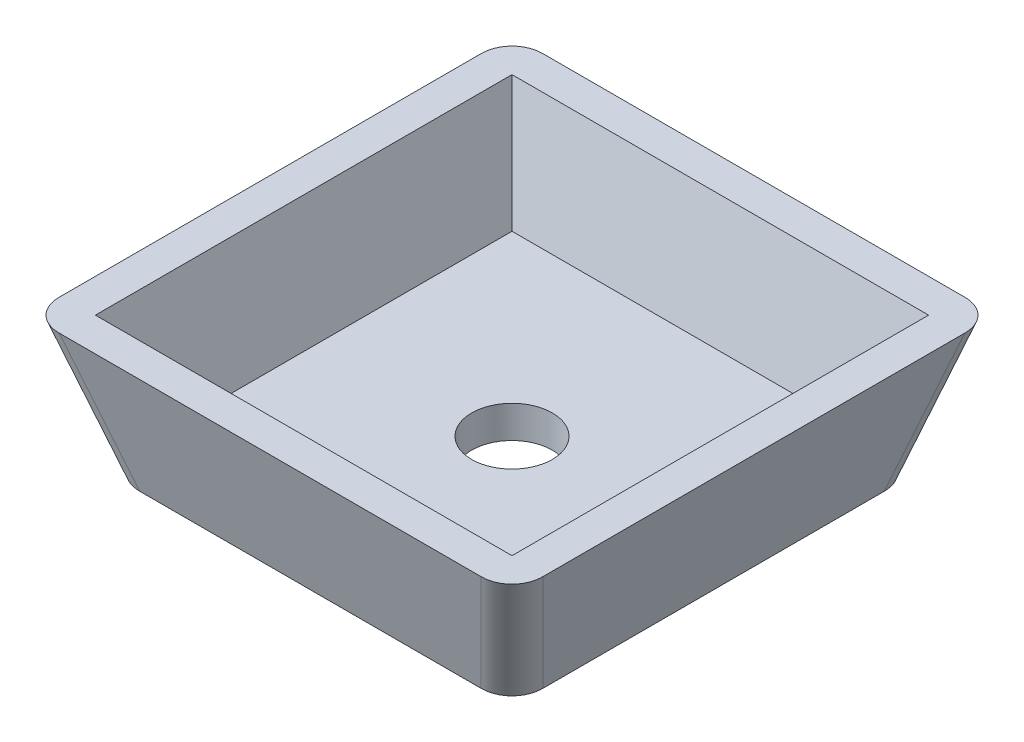
ISO-10303-21;
HEADER;
FILE_DESCRIPTION(('STEP AP214'),'2;1');
FILE_NAME('part.step','',(''),(''),'','','');
FILE_SCHEMA(('AUTOMOTIVE_DESIGN { 1 0 10303 214 1 1 1 1 }'));
ENDSEC;
DATA;
#1=APPLICATION_CONTEXT('core data for automotive mechanical design processes');
#2=APPLICATION_PROTOCOL_DEFINITION('international standard','automotive_design',2000,#1);
#3=PRODUCT_CONTEXT('',#1,'mechanical');
#4=PRODUCT('Part','Part','',(#3));
#5=PRODUCT_RELATED_PRODUCT_CATEGORY('part','',(#4));
#6=PRODUCT_DEFINITION_FORMATION('','',#4);
#7=PRODUCT_DEFINITION_CONTEXT('part definition',#1,'design');
#8=PRODUCT_DEFINITION('design','',#6,#7);
#9=PRODUCT_DEFINITION_SHAPE('','',#8);
#10=(LENGTH_UNIT() NAMED_UNIT(*) SI_UNIT(.MILLI.,.METRE.));
#11=(NAMED_UNIT(*) PLANE_ANGLE_UNIT() SI_UNIT($,.RADIAN.));
#12=(NAMED_UNIT(*) SI_UNIT($,.STERADIAN.) SOLID_ANGLE_UNIT());
#13=UNCERTAINTY_MEASURE_WITH_UNIT(LENGTH_MEASURE(1.E-05),#10,'distance_accuracy_value','');
#14=(GEOMETRIC_REPRESENTATION_CONTEXT(3) GLOBAL_UNCERTAINTY_ASSIGNED_CONTEXT((#13)) GLOBAL_UNIT_ASSIGNED_CONTEXT((#10,
#11,#12)) REPRESENTATION_CONTEXT('',''));
#15=CARTESIAN_POINT('',(0.,0.,0.));
#16=DIRECTION('',(0.,0.,1.));
#17=DIRECTION('',(1.,0.,0.));
#18=AXIS2_PLACEMENT_3D('',#15,#16,#17);
#19=CARTESIAN_POINT('',(0.,0.,0.));
#20=DIRECTION('',(0.,1.,0.));
#21=DIRECTION('',(0.,0.,1.));
#22=AXIS2_PLACEMENT_3D('',#19,#20,#21);
#23=PLANE('',#22);
#24=CARTESIAN_POINT('',(0.,0.,0.));
#25=DIRECTION('',(0.,-1.,0.));
#26=DIRECTION('',(0.,0.,-1.));
#27=AXIS2_PLACEMENT_3D('',#24,#25,#26);
#28=CIRCLE('',#27,2.5);
#29=CARTESIAN_POINT('',(0.,0.,-2.5));
#30=VERTEX_POINT('',#29);
#31=EDGE_CURVE('E461',#30,#30,#28,.T.);
#32=ORIENTED_EDGE('',*,*,#31,.F.);
#33=EDGE_LOOP('',(#32));
#34=FACE_BOUND('',#33,.T.);
#35=DIRECTION('',(-1.,0.,0.));
#36=VECTOR('',#35,1.);
#37=CARTESIAN_POINT('',(12.5,0.,-12.5));
#38=LINE('',#37,#36);
#39=CARTESIAN_POINT('',(10.5812689968575,0.,-12.5));
#40=VERTEX_POINT('',#39);
#41=CARTESIAN_POINT('',(-10.5812689968575,0.,-12.5));
#42=VERTEX_POINT('',#41);
#43=EDGE_CURVE('E281',#40,#42,#38,.T.);
#44=ORIENTED_EDGE('',*,*,#43,.F.);
#45=CARTESIAN_POINT('',(10.4152888062742,0.,-10.4152888062742));
#46=DIRECTION('',(0.,1.,0.));
#47=DIRECTION('',(-0.707106781186547,0.,0.707106781186548));
#48=AXIS2_PLACEMENT_3D('',#45,#46,#47);
#49=ELLIPSE('',#48,2.16611207523788,2.);
#50=CARTESIAN_POINT('',(12.5,0.,-10.5812689968575));
#51=VERTEX_POINT('',#50);
#52=EDGE_CURVE('E411',#40,#51,#49,.F.);
#53=ORIENTED_EDGE('',*,*,#52,.T.);
#54=DIRECTION('',(0.,0.,-1.));
#55=VECTOR('',#54,1.);
#56=CARTESIAN_POINT('',(12.5,0.,12.5));
#57=LINE('',#56,#55);
#58=CARTESIAN_POINT('',(12.5,0.,10.5812689968575));
#59=VERTEX_POINT('',#58);
#60=EDGE_CURVE('E360',#59,#51,#57,.T.);
#61=ORIENTED_EDGE('',*,*,#60,.F.);
#62=CARTESIAN_POINT('',(10.4152888062742,0.,10.4152888062742));
#63=DIRECTION('',(0.,1.,0.));
#64=DIRECTION('',(-0.707106781186547,0.,-0.707106781186548));
#65=AXIS2_PLACEMENT_3D('',#62,#63,#64);
#66=ELLIPSE('',#65,2.16611207523788,2.);
#67=CARTESIAN_POINT('',(10.5812689968575,0.,12.5));
#68=VERTEX_POINT('',#67);
#69=EDGE_CURVE('E234',#59,#68,#66,.F.);
#70=ORIENTED_EDGE('',*,*,#69,.T.);
#71=DIRECTION('',(1.,0.,0.));
#72=VECTOR('',#71,1.);
#73=CARTESIAN_POINT('',(12.5,0.,12.5));
#74=LINE('',#73,#72);
#75=CARTESIAN_POINT('',(-10.5812689968575,0.,12.5));
#76=VERTEX_POINT('',#75);
#77=EDGE_CURVE('E227',#76,#68,#74,.T.);
#78=ORIENTED_EDGE('',*,*,#77,.F.);
#79=CARTESIAN_POINT('',(-10.4152888062742,0.,10.4152888062742));
#80=DIRECTION('',(0.,1.,0.));
#81=DIRECTION('',(0.707106781186547,0.,-0.707106781186548));
#82=AXIS2_PLACEMENT_3D('',#79,#80,#81);
#83=ELLIPSE('',#82,2.16611207523788,2.);
#84=CARTESIAN_POINT('',(-12.5,0.,10.5812689968575));
#85=VERTEX_POINT('',#84);
#86=EDGE_CURVE('E427',#76,#85,#83,.F.);
#87=ORIENTED_EDGE('',*,*,#86,.T.);
#88=DIRECTION('',(0.,0.,1.));
#89=VECTOR('',#88,1.);
#90=CARTESIAN_POINT('',(-12.5,0.,12.5));
#91=LINE('',#90,#89);
#92=CARTESIAN_POINT('',(-12.5,0.,-10.5812689968575));
#93=VERTEX_POINT('',#92);
#94=EDGE_CURVE('E343',#93,#85,#91,.T.);
#95=ORIENTED_EDGE('',*,*,#94,.F.);
#96=CARTESIAN_POINT('',(-10.4152888062742,0.,-10.4152888062742));
#97=DIRECTION('',(0.,1.,0.));
#98=DIRECTION('',(0.707106781186548,0.,0.707106781186547));
#99=AXIS2_PLACEMENT_3D('',#96,#97,#98);
#100=ELLIPSE('',#99,2.16611207523788,2.);
#101=EDGE_CURVE('E423',#93,#42,#100,.F.);
#102=ORIENTED_EDGE('',*,*,#101,.T.);
#103=EDGE_LOOP('',(#44,#53,#61,#70,#78,#87,#95,#102));
#104=FACE_BOUND('',#103,.T.);
#105=ADVANCED_FACE('F53',(#34,#104),#23,.F.);
#106=CARTESIAN_POINT('',(0.,8.5,0.));
#107=DIRECTION('',(0.,1.,0.));
#108=DIRECTION('',(0.,0.,1.));
#109=AXIS2_PLACEMENT_3D('',#106,#107,#108);
#110=PLANE('',#109);
#111=DIRECTION('',(0.,0.,-1.));
#112=VECTOR('',#111,1.);
#113=CARTESIAN_POINT('',(12.9152888062742,8.5,0.));
#114=LINE('',#113,#112);
#115=CARTESIAN_POINT('',(12.9152888062742,8.5,12.9152888062742));
#116=VERTEX_POINT('',#115);
#117=CARTESIAN_POINT('',(12.9152888062742,8.5,-12.9152888062742));
#118=VERTEX_POINT('',#117);
#119=EDGE_CURVE('E169',#116,#118,#114,.T.);
#120=ORIENTED_EDGE('',*,*,#119,.F.);
#121=DIRECTION('',(1.,0.,0.));
#122=VECTOR('',#121,1.);
#123=CARTESIAN_POINT('',(0.,8.5,12.9152888062742));
#124=LINE('',#123,#122);
#125=CARTESIAN_POINT('',(-12.9152888062742,8.5,12.9152888062742));
#126=VERTEX_POINT('',#125);
#127=EDGE_CURVE('E166',#126,#116,#124,.T.);
#128=ORIENTED_EDGE('',*,*,#127,.F.);
#129=DIRECTION('',(0.,0.,1.));
#130=VECTOR('',#129,1.);
#131=CARTESIAN_POINT('',(-12.9152888062742,8.5,0.));
#132=LINE('',#131,#130);
#133=CARTESIAN_POINT('',(-12.9152888062742,8.5,-12.9152888062742));
#134=VERTEX_POINT('',#133);
#135=EDGE_CURVE('E70',#134,#126,#132,.T.);
#136=ORIENTED_EDGE('',*,*,#135,.F.);
#137=DIRECTION('',(-1.,0.,0.));
#138=VECTOR('',#137,1.);
#139=CARTESIAN_POINT('',(0.,8.5,-12.9152888062742));
#140=LINE('',#139,#138);
#141=EDGE_CURVE('E159',#118,#134,#140,.T.);
#142=ORIENTED_EDGE('',*,*,#141,.F.);
#143=EDGE_LOOP('',(#120,#128,#136,#142));
#144=FACE_BOUND('',#143,.T.);
#145=DIRECTION('',(0.,0.,-1.));
#146=VECTOR('',#145,1.);
#147=CARTESIAN_POINT('',(15.,8.5,15.));
#148=LINE('',#147,#146);
#149=CARTESIAN_POINT('',(15.,8.5,13.0812689968575));
#150=VERTEX_POINT('',#149);
#151=CARTESIAN_POINT('',(15.,8.5,-13.0812689968575));
#152=VERTEX_POINT('',#151);
#153=EDGE_CURVE('E339',#150,#152,#148,.T.);
#154=ORIENTED_EDGE('',*,*,#153,.T.);
#155=CARTESIAN_POINT('',(12.9152888062742,8.5,-12.9152888062742));
#156=DIRECTION('',(0.,1.,0.));
#157=DIRECTION('',(-0.707106781186547,0.,0.707106781186548));
#158=AXIS2_PLACEMENT_3D('',#155,#156,#157);
#159=ELLIPSE('',#158,2.16611207523788,2.);
#160=CARTESIAN_POINT('',(13.0812689968575,8.5,-15.));
#161=VERTEX_POINT('',#160);
#162=EDGE_CURVE('E394',#152,#161,#159,.T.);
#163=ORIENTED_EDGE('',*,*,#162,.T.);
#164=DIRECTION('',(-1.,0.,0.));
#165=VECTOR('',#164,1.);
#166=CARTESIAN_POINT('',(15.,8.5,-15.));
#167=LINE('',#166,#165);
#168=CARTESIAN_POINT('',(-13.0812689968575,8.5,-15.));
#169=VERTEX_POINT('',#168);
#170=EDGE_CURVE('E287',#161,#169,#167,.T.);
#171=ORIENTED_EDGE('',*,*,#170,.T.);
#172=CARTESIAN_POINT('',(-12.9152888062742,8.5,-12.9152888062742));
#173=DIRECTION('',(0.,1.,0.));
#174=DIRECTION('',(0.707106781186548,0.,0.707106781186547));
#175=AXIS2_PLACEMENT_3D('',#172,#173,#174);
#176=ELLIPSE('',#175,2.16611207523788,2.);
#177=CARTESIAN_POINT('',(-15.,8.5,-13.0812689968575));
#178=VERTEX_POINT('',#177);
#179=EDGE_CURVE('E398',#169,#178,#176,.T.);
#180=ORIENTED_EDGE('',*,*,#179,.T.);
#181=DIRECTION('',(0.,0.,1.));
#182=VECTOR('',#181,1.);
#183=CARTESIAN_POINT('',(-15.,8.5,15.));
#184=LINE('',#183,#182);
#185=CARTESIAN_POINT('',(-15.,8.5,13.0812689968575));
#186=VERTEX_POINT('',#185);
#187=EDGE_CURVE('E177',#178,#186,#184,.T.);
#188=ORIENTED_EDGE('',*,*,#187,.T.);
#189=CARTESIAN_POINT('',(-12.9152888062742,8.5,12.9152888062742));
#190=DIRECTION('',(0.,1.,0.));
#191=DIRECTION('',(0.707106781186547,0.,-0.707106781186548));
#192=AXIS2_PLACEMENT_3D('',#189,#190,#191);
#193=ELLIPSE('',#192,2.16611207523788,2.);
#194=CARTESIAN_POINT('',(-13.0812689968575,8.5,15.));
#195=VERTEX_POINT('',#194);
#196=EDGE_CURVE('E402',#186,#195,#193,.T.);
#197=ORIENTED_EDGE('',*,*,#196,.T.);
#198=DIRECTION('',(1.,0.,0.));
#199=VECTOR('',#198,1.);
#200=CARTESIAN_POINT('',(15.,8.5,15.));
#201=LINE('',#200,#199);
#202=CARTESIAN_POINT('',(13.0812689968575,8.5,15.));
#203=VERTEX_POINT('',#202);
#204=EDGE_CURVE('E322',#195,#203,#201,.T.);
#205=ORIENTED_EDGE('',*,*,#204,.T.);
#206=CARTESIAN_POINT('',(12.9152888062742,8.5,12.9152888062742));
#207=DIRECTION('',(0.,1.,0.));
#208=DIRECTION('',(-0.707106781186547,0.,-0.707106781186548));
#209=AXIS2_PLACEMENT_3D('',#206,#207,#208);
#210=ELLIPSE('',#209,2.16611207523788,2.);
#211=EDGE_CURVE('E406',#203,#150,#210,.T.);
#212=ORIENTED_EDGE('',*,*,#211,.T.);
#213=EDGE_LOOP('',(#154,#163,#171,#180,#188,#197,#205,#212));
#214=FACE_BOUND('',#213,.T.);
#215=ADVANCED_FACE('F203',(#144,#214),#110,.T.);
#216=CARTESIAN_POINT('',(0.,-3.38375796178344,11.5047770700637));
#217=DIRECTION('',(0.,-0.28216632399155,0.959365501571271));
#218=DIRECTION('',(0.,-0.959365501571271,-0.28216632399155));
#219=AXIS2_PLACEMENT_3D('',#216,#217,#218);
#220=PLANE('',#219);
#221=ORIENTED_EDGE('',*,*,#204,.F.);
#222=DIRECTION('',(0.271562723296784,-0.923313259209066,-0.271562723296784));
#223=VECTOR('',#222,1.);
#224=CARTESIAN_POINT('',(-8.87911051626325,-5.78733883402031,10.7978415194058));
#225=LINE('',#224,#223);
#226=EDGE_CURVE('E12',#195,#76,#225,.T.);
#227=ORIENTED_EDGE('',*,*,#226,.T.);
#228=ORIENTED_EDGE('',*,*,#77,.T.);
#229=DIRECTION('',(-0.271562723296784,-0.923313259209066,-0.271562723296784));
#230=VECTOR('',#229,1.);
#231=CARTESIAN_POINT('',(8.87911051626326,-5.78733883402031,10.7978415194058));
#232=LINE('',#231,#230);
#233=EDGE_CURVE('E62',#68,#203,#232,.F.);
#234=ORIENTED_EDGE('',*,*,#233,.T.);
#235=EDGE_LOOP('',(#221,#227,#228,#234));
#236=FACE_BOUND('',#235,.T.);
#237=ADVANCED_FACE('F192',(#236),#220,.T.);
#238=CARTESIAN_POINT('',(11.5047770700637,-3.38375796178344,0.));
#239=DIRECTION('',(0.959365501571271,-0.28216632399155,0.));
#240=DIRECTION('',(0.28216632399155,0.959365501571271,0.));
#241=AXIS2_PLACEMENT_3D('',#238,#239,#240);
#242=PLANE('',#241);
#243=ORIENTED_EDGE('',*,*,#60,.T.);
#244=DIRECTION('',(-0.271562723296784,-0.923313259209067,0.271562723296784));
#245=VECTOR('',#244,1.);
#246=CARTESIAN_POINT('',(10.7978415194058,-5.7873388340203,-8.87911051626325));
#247=LINE('',#246,#245);
#248=EDGE_CURVE('E408',#51,#152,#247,.F.);
#249=ORIENTED_EDGE('',*,*,#248,.T.);
#250=ORIENTED_EDGE('',*,*,#153,.F.);
#251=DIRECTION('',(-0.271562723296784,-0.923313259209066,-0.271562723296784));
#252=VECTOR('',#251,1.);
#253=CARTESIAN_POINT('',(10.7978415194058,-5.78733883402031,8.87911051626325));
#254=LINE('',#253,#252);
#255=EDGE_CURVE('E410',#150,#59,#254,.T.);
#256=ORIENTED_EDGE('',*,*,#255,.T.);
#257=EDGE_LOOP('',(#243,#249,#250,#256));
#258=FACE_BOUND('',#257,.T.);
#259=ADVANCED_FACE('F202',(#258),#242,.T.);
#260=CARTESIAN_POINT('',(-11.5047770700637,-3.38375796178344,0.));
#261=DIRECTION('',(-0.959365501571271,-0.28216632399155,0.));
#262=DIRECTION('',(0.28216632399155,-0.959365501571271,0.));
#263=AXIS2_PLACEMENT_3D('',#260,#261,#262);
#264=PLANE('',#263);
#265=ORIENTED_EDGE('',*,*,#187,.F.);
#266=DIRECTION('',(0.271562723296784,-0.923313259209066,0.271562723296784));
#267=VECTOR('',#266,1.);
#268=CARTESIAN_POINT('',(-10.7978415194058,-5.7873388340203,-8.87911051626325));
#269=LINE('',#268,#267);
#270=EDGE_CURVE('E386',#178,#93,#269,.T.);
#271=ORIENTED_EDGE('',*,*,#270,.T.);
#272=ORIENTED_EDGE('',*,*,#94,.T.);
#273=DIRECTION('',(0.271562723296784,-0.923313259209066,-0.271562723296784));
#274=VECTOR('',#273,1.);
#275=CARTESIAN_POINT('',(-10.7978415194058,-5.78733883402031,8.87911051626325));
#276=LINE('',#275,#274);
#277=EDGE_CURVE('E390',#85,#186,#276,.F.);
#278=ORIENTED_EDGE('',*,*,#277,.T.);
#279=EDGE_LOOP('',(#265,#271,#272,#278));
#280=FACE_BOUND('',#279,.T.);
#281=ADVANCED_FACE('F433',(#280),#264,.T.);
#282=CARTESIAN_POINT('',(0.,-3.38375796178344,-11.5047770700637));
#283=DIRECTION('',(0.,-0.28216632399155,-0.959365501571271));
#284=DIRECTION('',(0.,0.959365501571271,-0.28216632399155));
#285=AXIS2_PLACEMENT_3D('',#282,#283,#284);
#286=PLANE('',#285);
#287=ORIENTED_EDGE('',*,*,#170,.F.);
#288=DIRECTION('',(-0.271562723296784,-0.923313259209067,0.271562723296784));
#289=VECTOR('',#288,1.);
#290=CARTESIAN_POINT('',(8.87911051626326,-5.7873388340203,-10.7978415194058));
#291=LINE('',#290,#289);
#292=EDGE_CURVE('E369',#161,#40,#291,.T.);
#293=ORIENTED_EDGE('',*,*,#292,.T.);
#294=ORIENTED_EDGE('',*,*,#43,.T.);
#295=DIRECTION('',(0.271562723296784,-0.923313259209066,0.271562723296784));
#296=VECTOR('',#295,1.);
#297=CARTESIAN_POINT('',(-8.87911051626325,-5.7873388340203,-10.7978415194058));
#298=LINE('',#297,#296);
#299=EDGE_CURVE('E372',#42,#169,#298,.F.);
#300=ORIENTED_EDGE('',*,*,#299,.T.);
#301=EDGE_LOOP('',(#287,#293,#294,#300));
#302=FACE_BOUND('',#301,.T.);
#303=ADVANCED_FACE('F254',(#302),#286,.T.);
#304=CARTESIAN_POINT('',(8.87911051626326,-5.2230061860372,-8.87911051626325));
#305=DIRECTION('',(-0.271562723296784,-0.923313259209066,0.271562723296784));
#306=DIRECTION('',(0.,-0.28216632399155,-0.959365501571271));
#307=AXIS2_PLACEMENT_3D('',#304,#305,#306);
#308=CYLINDRICAL_SURFACE('',#307,2.);
#309=ORIENTED_EDGE('',*,*,#162,.F.);
#310=ORIENTED_EDGE('',*,*,#248,.F.);
#311=ORIENTED_EDGE('',*,*,#52,.F.);
#312=ORIENTED_EDGE('',*,*,#292,.F.);
#313=EDGE_LOOP('',(#309,#310,#311,#312));
#314=FACE_BOUND('',#313,.T.);
#315=ADVANCED_FACE('F256',(#314),#308,.T.);
#316=CARTESIAN_POINT('',(-8.87911051626325,-5.2230061860372,-8.87911051626325));
#317=DIRECTION('',(0.271562723296784,-0.923313259209066,0.271562723296784));
#318=DIRECTION('',(0.959365501571271,0.28216632399155,0.));
#319=AXIS2_PLACEMENT_3D('',#316,#317,#318);
#320=CYLINDRICAL_SURFACE('',#319,2.);
#321=ORIENTED_EDGE('',*,*,#179,.F.);
#322=ORIENTED_EDGE('',*,*,#299,.F.);
#323=ORIENTED_EDGE('',*,*,#101,.F.);
#324=ORIENTED_EDGE('',*,*,#270,.F.);
#325=EDGE_LOOP('',(#321,#322,#323,#324));
#326=FACE_BOUND('',#325,.T.);
#327=ADVANCED_FACE('F445',(#326),#320,.T.);
#328=CARTESIAN_POINT('',(-8.87911051626325,-5.22300618603721,8.87911051626325));
#329=DIRECTION('',(0.271562723296784,-0.923313259209066,-0.271562723296784));
#330=DIRECTION('',(0.,0.28216632399155,-0.959365501571271));
#331=AXIS2_PLACEMENT_3D('',#328,#329,#330);
#332=CYLINDRICAL_SURFACE('',#331,2.);
#333=ORIENTED_EDGE('',*,*,#196,.F.);
#334=ORIENTED_EDGE('',*,*,#277,.F.);
#335=ORIENTED_EDGE('',*,*,#86,.F.);
#336=ORIENTED_EDGE('',*,*,#226,.F.);
#337=EDGE_LOOP('',(#333,#334,#335,#336));
#338=FACE_BOUND('',#337,.T.);
#339=ADVANCED_FACE('F478',(#338),#332,.T.);
#340=CARTESIAN_POINT('',(8.87911051626326,-5.22300618603721,8.87911051626325));
#341=DIRECTION('',(-0.271562723296784,-0.923313259209066,-0.271562723296784));
#342=DIRECTION('',(0.,0.28216632399155,-0.959365501571271));
#343=AXIS2_PLACEMENT_3D('',#340,#341,#342);
#344=CYLINDRICAL_SURFACE('',#343,2.);
#345=ORIENTED_EDGE('',*,*,#211,.F.);
#346=ORIENTED_EDGE('',*,*,#233,.F.);
#347=ORIENTED_EDGE('',*,*,#69,.F.);
#348=ORIENTED_EDGE('',*,*,#255,.F.);
#349=EDGE_LOOP('',(#345,#346,#347,#348));
#350=FACE_BOUND('',#349,.T.);
#351=ADVANCED_FACE('F55',(#350),#344,.T.);
#352=CARTESIAN_POINT('',(0.,2.,0.));
#353=DIRECTION('',(0.,1.,0.));
#354=DIRECTION('',(0.,0.,1.));
#355=AXIS2_PLACEMENT_3D('',#352,#353,#354);
#356=PLANE('',#355);
#357=CARTESIAN_POINT('',(0.,2.,0.));
#358=DIRECTION('',(0.,1.,0.));
#359=DIRECTION('',(0.,0.,1.));
#360=AXIS2_PLACEMENT_3D('',#357,#358,#359);
#361=CIRCLE('',#360,2.5);
#362=CARTESIAN_POINT('',(0.,2.,2.5));
#363=VERTEX_POINT('',#362);
#364=EDGE_CURVE('E57',#363,#363,#361,.T.);
#365=ORIENTED_EDGE('',*,*,#364,.F.);
#366=EDGE_LOOP('',(#365));
#367=FACE_BOUND('',#366,.T.);
#368=DIRECTION('',(-1.,0.,0.));
#369=VECTOR('',#368,1.);
#370=CARTESIAN_POINT('',(0.,2.,-11.0035241003918));
#371=LINE('',#370,#369);
#372=CARTESIAN_POINT('',(11.0035241003918,2.,-11.0035241003918));
#373=VERTEX_POINT('',#372);
#374=CARTESIAN_POINT('',(-11.0035241003918,2.,-11.0035241003918));
#375=VERTEX_POINT('',#374);
#376=EDGE_CURVE('E145',#373,#375,#371,.T.);
#377=ORIENTED_EDGE('',*,*,#376,.T.);
#378=DIRECTION('',(0.,0.,1.));
#379=VECTOR('',#378,1.);
#380=CARTESIAN_POINT('',(-11.0035241003918,2.,0.));
#381=LINE('',#380,#379);
#382=CARTESIAN_POINT('',(-11.0035241003918,2.,11.0035241003918));
#383=VERTEX_POINT('',#382);
#384=EDGE_CURVE('E149',#375,#383,#381,.T.);
#385=ORIENTED_EDGE('',*,*,#384,.T.);
#386=DIRECTION('',(1.,0.,0.));
#387=VECTOR('',#386,1.);
#388=CARTESIAN_POINT('',(0.,2.,11.0035241003918));
#389=LINE('',#388,#387);
#390=CARTESIAN_POINT('',(11.0035241003918,2.,11.0035241003918));
#391=VERTEX_POINT('',#390);
#392=EDGE_CURVE('E161',#383,#391,#389,.T.);
#393=ORIENTED_EDGE('',*,*,#392,.T.);
#394=DIRECTION('',(0.,0.,-1.));
#395=VECTOR('',#394,1.);
#396=CARTESIAN_POINT('',(11.0035241003918,2.,0.));
#397=LINE('',#396,#395);
#398=EDGE_CURVE('E151',#391,#373,#397,.T.);
#399=ORIENTED_EDGE('',*,*,#398,.T.);
#400=EDGE_LOOP('',(#377,#385,#393,#399));
#401=FACE_BOUND('',#400,.T.);
#402=ADVANCED_FACE('F147',(#367,#401),#356,.T.);
#403=CARTESIAN_POINT('',(0.,-2.81942531380034,9.58604606692115));
#404=DIRECTION('',(0.,-0.28216632399155,0.959365501571271));
#405=DIRECTION('',(0.,-0.959365501571271,-0.28216632399155));
#406=AXIS2_PLACEMENT_3D('',#403,#404,#405);
#407=PLANE('',#406);
#408=ORIENTED_EDGE('',*,*,#127,.T.);
#409=DIRECTION('',(0.271562723296784,0.923313259209066,0.271562723296784));
#410=VECTOR('',#409,1.);
#411=CARTESIAN_POINT('',(8.87911051626326,-5.22300618603721,8.87911051626325));
#412=LINE('',#411,#410);
#413=EDGE_CURVE('E175',#391,#116,#412,.T.);
#414=ORIENTED_EDGE('',*,*,#413,.F.);
#415=ORIENTED_EDGE('',*,*,#392,.F.);
#416=DIRECTION('',(-0.271562723296784,0.923313259209066,0.271562723296784));
#417=VECTOR('',#416,1.);
#418=CARTESIAN_POINT('',(-8.87911051626325,-5.22300618603721,8.87911051626325));
#419=LINE('',#418,#417);
#420=EDGE_CURVE('E164',#383,#126,#419,.T.);
#421=ORIENTED_EDGE('',*,*,#420,.T.);
#422=EDGE_LOOP('',(#408,#414,#415,#421));
#423=FACE_BOUND('',#422,.T.);
#424=ADVANCED_FACE('F459',(#423),#407,.F.);
#425=CARTESIAN_POINT('',(9.58604606692116,-2.81942531380034,0.));
#426=DIRECTION('',(0.959365501571271,-0.28216632399155,0.));
#427=DIRECTION('',(0.28216632399155,0.959365501571271,0.));
#428=AXIS2_PLACEMENT_3D('',#425,#426,#427);
#429=PLANE('',#428);
#430=ORIENTED_EDGE('',*,*,#398,.F.);
#431=ORIENTED_EDGE('',*,*,#413,.T.);
#432=ORIENTED_EDGE('',*,*,#119,.T.);
#433=DIRECTION('',(0.271562723296784,0.923313259209066,-0.271562723296784));
#434=VECTOR('',#433,1.);
#435=CARTESIAN_POINT('',(8.87911051626326,-5.2230061860372,-8.87911051626325));
#436=LINE('',#435,#434);
#437=EDGE_CURVE('E160',#373,#118,#436,.T.);
#438=ORIENTED_EDGE('',*,*,#437,.F.);
#439=EDGE_LOOP('',(#430,#431,#432,#438));
#440=FACE_BOUND('',#439,.T.);
#441=ADVANCED_FACE('F456',(#440),#429,.F.);
#442=CARTESIAN_POINT('',(-9.58604606692115,-2.81942531380034,0.));
#443=DIRECTION('',(-0.959365501571271,-0.28216632399155,0.));
#444=DIRECTION('',(0.28216632399155,-0.959365501571271,0.));
#445=AXIS2_PLACEMENT_3D('',#442,#443,#444);
#446=PLANE('',#445);
#447=ORIENTED_EDGE('',*,*,#135,.T.);
#448=ORIENTED_EDGE('',*,*,#420,.F.);
#449=ORIENTED_EDGE('',*,*,#384,.F.);
#450=DIRECTION('',(-0.271562723296784,0.923313259209066,-0.271562723296784));
#451=VECTOR('',#450,1.);
#452=CARTESIAN_POINT('',(-8.87911051626325,-5.2230061860372,-8.87911051626325));
#453=LINE('',#452,#451);
#454=EDGE_CURVE('E156',#375,#134,#453,.T.);
#455=ORIENTED_EDGE('',*,*,#454,.T.);
#456=EDGE_LOOP('',(#447,#448,#449,#455));
#457=FACE_BOUND('',#456,.T.);
#458=ADVANCED_FACE('F163',(#457),#446,.F.);
#459=CARTESIAN_POINT('',(0.,-2.81942531380034,-9.58604606692115));
#460=DIRECTION('',(0.,-0.28216632399155,-0.959365501571271));
#461=DIRECTION('',(0.,0.959365501571271,-0.28216632399155));
#462=AXIS2_PLACEMENT_3D('',#459,#460,#461);
#463=PLANE('',#462);
#464=ORIENTED_EDGE('',*,*,#141,.T.);
#465=ORIENTED_EDGE('',*,*,#454,.F.);
#466=ORIENTED_EDGE('',*,*,#376,.F.);
#467=ORIENTED_EDGE('',*,*,#437,.T.);
#468=EDGE_LOOP('',(#464,#465,#466,#467));
#469=FACE_BOUND('',#468,.T.);
#470=ADVANCED_FACE('F157',(#469),#463,.F.);
#471=CARTESIAN_POINT('',(0.,10.,0.));
#472=DIRECTION('',(0.,-1.,0.));
#473=DIRECTION('',(0.,0.,-1.));
#474=AXIS2_PLACEMENT_3D('',#471,#472,#473);
#475=CYLINDRICAL_SURFACE('',#474,2.5);
#476=ORIENTED_EDGE('',*,*,#364,.T.);
#477=EDGE_LOOP('',(#476));
#478=FACE_BOUND('',#477,.T.);
#479=ORIENTED_EDGE('',*,*,#31,.T.);
#480=EDGE_LOOP('',(#479));
#481=FACE_BOUND('',#480,.T.);
#482=ADVANCED_FACE('F468',(#478,#481),#475,.F.);
#483=CLOSED_SHELL('',(#105,#215,#237,#259,#281,#303,#315,#327,#339,#351,#402,#424,#441,#458,
#470,#482));
#484=MANIFOLD_SOLID_BREP('B2',#483);
#485=ADVANCED_BREP_SHAPE_REPRESENTATION('',(#18,#484),#14);
#486=SHAPE_DEFINITION_REPRESENTATION(#9,#485);
ENDSEC;
END-ISO-10303-21;
